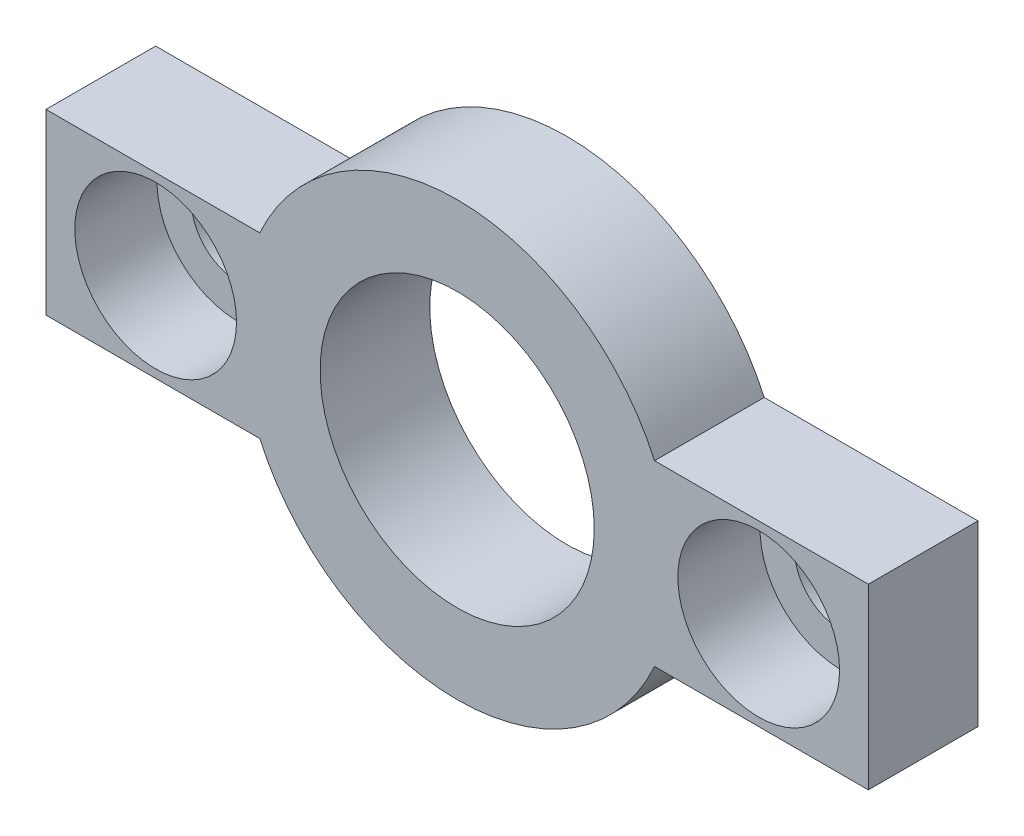
ISO-10303-21;
HEADER;
FILE_DESCRIPTION(('STEP AP214'),'2;1');
FILE_NAME('part.step','',(''),(''),'','','');
FILE_SCHEMA(('AUTOMOTIVE_DESIGN { 1 0 10303 214 1 1 1 1 }'));
ENDSEC;
DATA;
#1=APPLICATION_CONTEXT('core data for automotive mechanical design processes');
#2=APPLICATION_PROTOCOL_DEFINITION('international standard','automotive_design',2000,#1);
#3=PRODUCT_CONTEXT('',#1,'mechanical');
#4=PRODUCT('Part','Part','',(#3));
#5=PRODUCT_RELATED_PRODUCT_CATEGORY('part','',(#4));
#6=PRODUCT_DEFINITION_FORMATION('','',#4);
#7=PRODUCT_DEFINITION_CONTEXT('part definition',#1,'design');
#8=PRODUCT_DEFINITION('design','',#6,#7);
#9=PRODUCT_DEFINITION_SHAPE('','',#8);
#10=(LENGTH_UNIT() NAMED_UNIT(*) SI_UNIT(.MILLI.,.METRE.));
#11=(NAMED_UNIT(*) PLANE_ANGLE_UNIT() SI_UNIT($,.RADIAN.));
#12=(NAMED_UNIT(*) SI_UNIT($,.STERADIAN.) SOLID_ANGLE_UNIT());
#13=UNCERTAINTY_MEASURE_WITH_UNIT(LENGTH_MEASURE(1.E-05),#10,'distance_accuracy_value','');
#14=(GEOMETRIC_REPRESENTATION_CONTEXT(3) GLOBAL_UNCERTAINTY_ASSIGNED_CONTEXT((#13)) GLOBAL_UNIT_ASSIGNED_CONTEXT((#10,
#11,#12)) REPRESENTATION_CONTEXT('',''));
#15=CARTESIAN_POINT('',(0.,0.,0.));
#16=DIRECTION('',(0.,0.,1.));
#17=DIRECTION('',(1.,0.,0.));
#18=AXIS2_PLACEMENT_3D('',#15,#16,#17);
#19=CARTESIAN_POINT('',(11.,0.,1.));
#20=DIRECTION('',(0.,0.,1.));
#21=DIRECTION('',(1.,0.,0.));
#22=AXIS2_PLACEMENT_3D('',#19,#20,#21);
#23=PLANE('',#22);
#24=CARTESIAN_POINT('',(11.,0.,1.));
#25=DIRECTION('',(0.,0.,-1.));
#26=DIRECTION('',(1.,0.,0.));
#27=AXIS2_PLACEMENT_3D('',#24,#25,#26);
#28=CIRCLE('',#27,1.7);
#29=CARTESIAN_POINT('',(12.7,0.,1.));
#30=VERTEX_POINT('',#29);
#31=EDGE_CURVE('E262',#30,#30,#28,.T.);
#32=ORIENTED_EDGE('',*,*,#31,.T.);
#33=EDGE_LOOP('',(#32));
#34=FACE_BOUND('',#33,.T.);
#35=CARTESIAN_POINT('',(11.,0.,1.));
#36=DIRECTION('',(0.,0.,1.));
#37=DIRECTION('',(1.,0.,0.));
#38=AXIS2_PLACEMENT_3D('',#35,#36,#37);
#39=CIRCLE('',#38,2.95);
#40=CARTESIAN_POINT('',(13.95,0.,1.));
#41=VERTEX_POINT('',#40);
#42=EDGE_CURVE('E10',#41,#41,#39,.T.);
#43=ORIENTED_EDGE('',*,*,#42,.T.);
#44=EDGE_LOOP('',(#43));
#45=FACE_BOUND('',#44,.T.);
#46=ADVANCED_FACE('F15',(#34,#45),#23,.T.);
#47=CARTESIAN_POINT('',(-11.,0.,1.));
#48=DIRECTION('',(0.,0.,1.));
#49=DIRECTION('',(1.,0.,0.));
#50=AXIS2_PLACEMENT_3D('',#47,#48,#49);
#51=PLANE('',#50);
#52=CARTESIAN_POINT('',(-11.,0.,1.));
#53=DIRECTION('',(0.,0.,-1.));
#54=DIRECTION('',(1.,0.,0.));
#55=AXIS2_PLACEMENT_3D('',#52,#53,#54);
#56=CIRCLE('',#55,1.7);
#57=CARTESIAN_POINT('',(-9.3,0.,1.));
#58=VERTEX_POINT('',#57);
#59=EDGE_CURVE('E206',#58,#58,#56,.T.);
#60=ORIENTED_EDGE('',*,*,#59,.T.);
#61=EDGE_LOOP('',(#60));
#62=FACE_BOUND('',#61,.T.);
#63=CARTESIAN_POINT('',(-11.,0.,1.));
#64=DIRECTION('',(0.,0.,1.));
#65=DIRECTION('',(1.,0.,0.));
#66=AXIS2_PLACEMENT_3D('',#63,#64,#65);
#67=CIRCLE('',#66,2.95);
#68=CARTESIAN_POINT('',(-8.05,0.,1.));
#69=VERTEX_POINT('',#68);
#70=EDGE_CURVE('E211',#69,#69,#67,.T.);
#71=ORIENTED_EDGE('',*,*,#70,.T.);
#72=EDGE_LOOP('',(#71));
#73=FACE_BOUND('',#72,.T.);
#74=ADVANCED_FACE('F314',(#62,#73),#51,.T.);
#75=CARTESIAN_POINT('',(11.,0.,4.));
#76=DIRECTION('',(0.,0.,1.));
#77=DIRECTION('',(1.,0.,0.));
#78=AXIS2_PLACEMENT_3D('',#75,#76,#77);
#79=CYLINDRICAL_SURFACE('',#78,2.95);
#80=CARTESIAN_POINT('',(11.,0.,4.));
#81=DIRECTION('',(0.,0.,1.));
#82=DIRECTION('',(1.,0.,0.));
#83=AXIS2_PLACEMENT_3D('',#80,#81,#82);
#84=CIRCLE('',#83,2.95);
#85=CARTESIAN_POINT('',(13.95,0.,4.));
#86=VERTEX_POINT('',#85);
#87=EDGE_CURVE('E156',#86,#86,#84,.T.);
#88=ORIENTED_EDGE('',*,*,#87,.T.);
#89=DIRECTION('',(0.,0.,-1.));
#90=VECTOR('',#89,1.);
#91=CARTESIAN_POINT('',(13.95,0.,4.));
#92=LINE('',#91,#90);
#93=EDGE_CURVE('E26',#86,#41,#92,.T.);
#94=ORIENTED_EDGE('',*,*,#93,.T.);
#95=ORIENTED_EDGE('',*,*,#42,.F.);
#96=ORIENTED_EDGE('',*,*,#93,.F.);
#97=EDGE_LOOP('',(#88,#94,#95,#96));
#98=FACE_BOUND('',#97,.T.);
#99=ADVANCED_FACE('F320',(#98),#79,.F.);
#100=CARTESIAN_POINT('',(-11.,0.,4.));
#101=DIRECTION('',(0.,0.,1.));
#102=DIRECTION('',(1.,0.,0.));
#103=AXIS2_PLACEMENT_3D('',#100,#101,#102);
#104=CYLINDRICAL_SURFACE('',#103,2.95);
#105=CARTESIAN_POINT('',(-11.,0.,4.));
#106=DIRECTION('',(0.,0.,1.));
#107=DIRECTION('',(1.,0.,0.));
#108=AXIS2_PLACEMENT_3D('',#105,#106,#107);
#109=CIRCLE('',#108,2.95);
#110=CARTESIAN_POINT('',(-8.05,0.,4.));
#111=VERTEX_POINT('',#110);
#112=EDGE_CURVE('E188',#111,#111,#109,.T.);
#113=ORIENTED_EDGE('',*,*,#112,.T.);
#114=DIRECTION('',(0.,0.,-1.));
#115=VECTOR('',#114,1.);
#116=CARTESIAN_POINT('',(-8.05,0.,4.));
#117=LINE('',#116,#115);
#118=EDGE_CURVE('E207',#111,#69,#117,.T.);
#119=ORIENTED_EDGE('',*,*,#118,.T.);
#120=ORIENTED_EDGE('',*,*,#70,.F.);
#121=ORIENTED_EDGE('',*,*,#118,.F.);
#122=EDGE_LOOP('',(#113,#119,#120,#121));
#123=FACE_BOUND('',#122,.T.);
#124=ADVANCED_FACE('F324',(#123),#104,.F.);
#125=CARTESIAN_POINT('',(11.,0.,0.));
#126=DIRECTION('',(0.,0.,-1.));
#127=DIRECTION('',(1.,0.,0.));
#128=AXIS2_PLACEMENT_3D('',#125,#126,#127);
#129=CYLINDRICAL_SURFACE('',#128,1.7);
#130=ORIENTED_EDGE('',*,*,#31,.F.);
#131=DIRECTION('',(0.,0.,1.));
#132=VECTOR('',#131,1.);
#133=CARTESIAN_POINT('',(12.7,0.,0.));
#134=LINE('',#133,#132);
#135=CARTESIAN_POINT('',(12.7,0.,0.));
#136=VERTEX_POINT('',#135);
#137=EDGE_CURVE('E183',#136,#30,#134,.T.);
#138=ORIENTED_EDGE('',*,*,#137,.F.);
#139=CARTESIAN_POINT('',(11.,0.,0.));
#140=DIRECTION('',(0.,0.,-1.));
#141=DIRECTION('',(1.,0.,0.));
#142=AXIS2_PLACEMENT_3D('',#139,#140,#141);
#143=CIRCLE('',#142,1.7);
#144=EDGE_CURVE('E224',#136,#136,#143,.T.);
#145=ORIENTED_EDGE('',*,*,#144,.T.);
#146=ORIENTED_EDGE('',*,*,#137,.T.);
#147=EDGE_LOOP('',(#130,#138,#145,#146));
#148=FACE_BOUND('',#147,.T.);
#149=ADVANCED_FACE('F327',(#148),#129,.F.);
#150=CARTESIAN_POINT('',(0.,0.,0.));
#151=DIRECTION('',(0.,0.,-1.));
#152=DIRECTION('',(1.,0.,0.));
#153=AXIS2_PLACEMENT_3D('',#150,#151,#152);
#154=CYLINDRICAL_SURFACE('',#153,5.);
#155=DIRECTION('',(0.,0.,1.));
#156=VECTOR('',#155,1.);
#157=CARTESIAN_POINT('',(5.,0.,0.));
#158=LINE('',#157,#156);
#159=CARTESIAN_POINT('',(5.,0.,0.));
#160=VERTEX_POINT('',#159);
#161=CARTESIAN_POINT('',(5.,0.,4.));
#162=VERTEX_POINT('',#161);
#163=EDGE_CURVE('E205',#160,#162,#158,.T.);
#164=ORIENTED_EDGE('',*,*,#163,.T.);
#165=CARTESIAN_POINT('',(0.,0.,4.));
#166=DIRECTION('',(0.,0.,1.));
#167=DIRECTION('',(1.,0.,0.));
#168=AXIS2_PLACEMENT_3D('',#165,#166,#167);
#169=CIRCLE('',#168,5.);
#170=EDGE_CURVE('E192',#162,#162,#169,.T.);
#171=ORIENTED_EDGE('',*,*,#170,.T.);
#172=ORIENTED_EDGE('',*,*,#163,.F.);
#173=CARTESIAN_POINT('',(0.,0.,0.));
#174=DIRECTION('',(0.,0.,1.));
#175=DIRECTION('',(1.,0.,0.));
#176=AXIS2_PLACEMENT_3D('',#173,#174,#175);
#177=CIRCLE('',#176,5.);
#178=EDGE_CURVE('E243',#160,#160,#177,.T.);
#179=ORIENTED_EDGE('',*,*,#178,.F.);
#180=EDGE_LOOP('',(#164,#171,#172,#179));
#181=FACE_BOUND('',#180,.T.);
#182=ADVANCED_FACE('F344',(#181),#154,.F.);
#183=CARTESIAN_POINT('',(-11.,0.,0.));
#184=DIRECTION('',(0.,0.,-1.));
#185=DIRECTION('',(1.,0.,0.));
#186=AXIS2_PLACEMENT_3D('',#183,#184,#185);
#187=CYLINDRICAL_SURFACE('',#186,1.7);
#188=ORIENTED_EDGE('',*,*,#59,.F.);
#189=DIRECTION('',(0.,0.,1.));
#190=VECTOR('',#189,1.);
#191=CARTESIAN_POINT('',(-9.3,0.,0.));
#192=LINE('',#191,#190);
#193=CARTESIAN_POINT('',(-9.3,0.,0.));
#194=VERTEX_POINT('',#193);
#195=EDGE_CURVE('E202',#194,#58,#192,.T.);
#196=ORIENTED_EDGE('',*,*,#195,.F.);
#197=CARTESIAN_POINT('',(-11.,0.,0.));
#198=DIRECTION('',(0.,0.,-1.));
#199=DIRECTION('',(1.,0.,0.));
#200=AXIS2_PLACEMENT_3D('',#197,#198,#199);
#201=CIRCLE('',#200,1.7);
#202=EDGE_CURVE('E233',#194,#194,#201,.T.);
#203=ORIENTED_EDGE('',*,*,#202,.T.);
#204=ORIENTED_EDGE('',*,*,#195,.T.);
#205=EDGE_LOOP('',(#188,#196,#203,#204));
#206=FACE_BOUND('',#205,.T.);
#207=ADVANCED_FACE('F342',(#206),#187,.F.);
#208=CARTESIAN_POINT('',(0.,0.,0.));
#209=DIRECTION('',(0.,0.,-1.));
#210=DIRECTION('',(1.,0.,0.));
#211=AXIS2_PLACEMENT_3D('',#208,#209,#210);
#212=CYLINDRICAL_SURFACE('',#211,7.9);
#213=CARTESIAN_POINT('',(0.,0.,0.));
#214=DIRECTION('',(0.,0.,1.));
#215=DIRECTION('',(1.,0.,0.));
#216=AXIS2_PLACEMENT_3D('',#213,#214,#215);
#217=CIRCLE('',#216,7.9);
#218=CARTESIAN_POINT('',(-7.200520814497,-3.25,0.));
#219=VERTEX_POINT('',#218);
#220=CARTESIAN_POINT('',(7.200520814497,-3.25,0.));
#221=VERTEX_POINT('',#220);
#222=EDGE_CURVE('E165',#219,#221,#217,.T.);
#223=ORIENTED_EDGE('',*,*,#222,.T.);
#224=DIRECTION('',(0.,0.,1.));
#225=VECTOR('',#224,1.);
#226=CARTESIAN_POINT('',(7.200520814497,-3.25,0.));
#227=LINE('',#226,#225);
#228=CARTESIAN_POINT('',(7.200520814497,-3.25,4.));
#229=VERTEX_POINT('',#228);
#230=EDGE_CURVE('E161',#221,#229,#227,.T.);
#231=ORIENTED_EDGE('',*,*,#230,.T.);
#232=CARTESIAN_POINT('',(0.,0.,4.));
#233=DIRECTION('',(0.,0.,1.));
#234=DIRECTION('',(1.,0.,0.));
#235=AXIS2_PLACEMENT_3D('',#232,#233,#234);
#236=CIRCLE('',#235,7.9);
#237=CARTESIAN_POINT('',(-7.200520814497,-3.25,4.));
#238=VERTEX_POINT('',#237);
#239=EDGE_CURVE('E200',#238,#229,#236,.T.);
#240=ORIENTED_EDGE('',*,*,#239,.F.);
#241=DIRECTION('',(0.,0.,1.));
#242=VECTOR('',#241,1.);
#243=CARTESIAN_POINT('',(-7.200520814497,-3.25,0.));
#244=LINE('',#243,#242);
#245=EDGE_CURVE('E110',#219,#238,#244,.T.);
#246=ORIENTED_EDGE('',*,*,#245,.F.);
#247=EDGE_LOOP('',(#223,#231,#240,#246));
#248=FACE_BOUND('',#247,.T.);
#249=ADVANCED_FACE('F298',(#248),#212,.T.);
#250=CARTESIAN_POINT('',(-15.,-3.25,0.));
#251=DIRECTION('',(0.,1.,0.));
#252=DIRECTION('',(1.,0.,0.));
#253=AXIS2_PLACEMENT_3D('',#250,#251,#252);
#254=PLANE('',#253);
#255=DIRECTION('',(1.,0.,0.));
#256=VECTOR('',#255,1.);
#257=CARTESIAN_POINT('',(-15.,-3.25,0.));
#258=LINE('',#257,#256);
#259=CARTESIAN_POINT('',(-15.,-3.25,0.));
#260=VERTEX_POINT('',#259);
#261=EDGE_CURVE('E187',#260,#219,#258,.T.);
#262=ORIENTED_EDGE('',*,*,#261,.T.);
#263=ORIENTED_EDGE('',*,*,#245,.T.);
#264=DIRECTION('',(1.,0.,0.));
#265=VECTOR('',#264,1.);
#266=CARTESIAN_POINT('',(-15.,-3.25,4.));
#267=LINE('',#266,#265);
#268=CARTESIAN_POINT('',(-15.,-3.25,4.));
#269=VERTEX_POINT('',#268);
#270=EDGE_CURVE('E196',#269,#238,#267,.T.);
#271=ORIENTED_EDGE('',*,*,#270,.F.);
#272=DIRECTION('',(0.,0.,1.));
#273=VECTOR('',#272,1.);
#274=CARTESIAN_POINT('',(-15.,-3.25,0.));
#275=LINE('',#274,#273);
#276=EDGE_CURVE('E95',#260,#269,#275,.T.);
#277=ORIENTED_EDGE('',*,*,#276,.F.);
#278=EDGE_LOOP('',(#262,#263,#271,#277));
#279=FACE_BOUND('',#278,.T.);
#280=ADVANCED_FACE('F297',(#279),#254,.F.);
#281=CARTESIAN_POINT('',(15.,-3.25,0.));
#282=DIRECTION('',(0.,-1.,0.));
#283=DIRECTION('',(0.,0.,-1.));
#284=AXIS2_PLACEMENT_3D('',#281,#282,#283);
#285=PLANE('',#284);
#286=DIRECTION('',(0.,0.,1.));
#287=VECTOR('',#286,1.);
#288=CARTESIAN_POINT('',(15.,-3.25,0.));
#289=LINE('',#288,#287);
#290=CARTESIAN_POINT('',(15.,-3.25,0.));
#291=VERTEX_POINT('',#290);
#292=CARTESIAN_POINT('',(15.,-3.25,4.));
#293=VERTEX_POINT('',#292);
#294=EDGE_CURVE('E144',#291,#293,#289,.T.);
#295=ORIENTED_EDGE('',*,*,#294,.T.);
#296=DIRECTION('',(-1.,0.,0.));
#297=VECTOR('',#296,1.);
#298=CARTESIAN_POINT('',(15.,-3.25,4.));
#299=LINE('',#298,#297);
#300=EDGE_CURVE('E246',#293,#229,#299,.T.);
#301=ORIENTED_EDGE('',*,*,#300,.T.);
#302=ORIENTED_EDGE('',*,*,#230,.F.);
#303=DIRECTION('',(-1.,0.,0.));
#304=VECTOR('',#303,1.);
#305=CARTESIAN_POINT('',(15.,-3.25,0.));
#306=LINE('',#305,#304);
#307=EDGE_CURVE('E159',#291,#221,#306,.T.);
#308=ORIENTED_EDGE('',*,*,#307,.F.);
#309=EDGE_LOOP('',(#295,#301,#302,#308));
#310=FACE_BOUND('',#309,.T.);
#311=ADVANCED_FACE('F160',(#310),#285,.T.);
#312=CARTESIAN_POINT('',(-15.,3.25,0.));
#313=DIRECTION('',(1.,0.,0.));
#314=DIRECTION('',(0.,1.,0.));
#315=AXIS2_PLACEMENT_3D('',#312,#313,#314);
#316=PLANE('',#315);
#317=DIRECTION('',(0.,-1.,0.));
#318=VECTOR('',#317,1.);
#319=CARTESIAN_POINT('',(-15.,3.25,0.));
#320=LINE('',#319,#318);
#321=CARTESIAN_POINT('',(-15.,3.25,0.));
#322=VERTEX_POINT('',#321);
#323=EDGE_CURVE('E214',#322,#260,#320,.T.);
#324=ORIENTED_EDGE('',*,*,#323,.T.);
#325=ORIENTED_EDGE('',*,*,#276,.T.);
#326=DIRECTION('',(0.,-1.,0.));
#327=VECTOR('',#326,1.);
#328=CARTESIAN_POINT('',(-15.,3.25,4.));
#329=LINE('',#328,#327);
#330=CARTESIAN_POINT('',(-15.,3.25,4.));
#331=VERTEX_POINT('',#330);
#332=EDGE_CURVE('E201',#331,#269,#329,.T.);
#333=ORIENTED_EDGE('',*,*,#332,.F.);
#334=DIRECTION('',(0.,0.,1.));
#335=VECTOR('',#334,1.);
#336=CARTESIAN_POINT('',(-15.,3.25,0.));
#337=LINE('',#336,#335);
#338=EDGE_CURVE('E179',#322,#331,#337,.T.);
#339=ORIENTED_EDGE('',*,*,#338,.F.);
#340=EDGE_LOOP('',(#324,#325,#333,#339));
#341=FACE_BOUND('',#340,.T.);
#342=ADVANCED_FACE('F293',(#341),#316,.F.);
#343=CARTESIAN_POINT('',(15.,3.25,0.));
#344=DIRECTION('',(1.,0.,0.));
#345=DIRECTION('',(0.,1.,0.));
#346=AXIS2_PLACEMENT_3D('',#343,#344,#345);
#347=PLANE('',#346);
#348=DIRECTION('',(0.,0.,1.));
#349=VECTOR('',#348,1.);
#350=CARTESIAN_POINT('',(15.,3.25,0.));
#351=LINE('',#350,#349);
#352=CARTESIAN_POINT('',(15.,3.25,0.));
#353=VERTEX_POINT('',#352);
#354=CARTESIAN_POINT('',(15.,3.25,4.));
#355=VERTEX_POINT('',#354);
#356=EDGE_CURVE('E229',#353,#355,#351,.T.);
#357=ORIENTED_EDGE('',*,*,#356,.T.);
#358=DIRECTION('',(0.,-1.,0.));
#359=VECTOR('',#358,1.);
#360=CARTESIAN_POINT('',(15.,3.25,4.));
#361=LINE('',#360,#359);
#362=EDGE_CURVE('E151',#355,#293,#361,.T.);
#363=ORIENTED_EDGE('',*,*,#362,.T.);
#364=ORIENTED_EDGE('',*,*,#294,.F.);
#365=DIRECTION('',(0.,-1.,0.));
#366=VECTOR('',#365,1.);
#367=CARTESIAN_POINT('',(15.,3.25,0.));
#368=LINE('',#367,#366);
#369=EDGE_CURVE('E149',#353,#291,#368,.T.);
#370=ORIENTED_EDGE('',*,*,#369,.F.);
#371=EDGE_LOOP('',(#357,#363,#364,#370));
#372=FACE_BOUND('',#371,.T.);
#373=ADVANCED_FACE('F147',(#372),#347,.T.);
#374=CARTESIAN_POINT('',(0.,0.,4.));
#375=DIRECTION('',(0.,0.,1.));
#376=DIRECTION('',(1.,0.,0.));
#377=AXIS2_PLACEMENT_3D('',#374,#375,#376);
#378=PLANE('',#377);
#379=ORIENTED_EDGE('',*,*,#87,.F.);
#380=EDGE_LOOP('',(#379));
#381=FACE_BOUND('',#380,.T.);
#382=ORIENTED_EDGE('',*,*,#170,.F.);
#383=EDGE_LOOP('',(#382));
#384=FACE_BOUND('',#383,.T.);
#385=ORIENTED_EDGE('',*,*,#112,.F.);
#386=EDGE_LOOP('',(#385));
#387=FACE_BOUND('',#386,.T.);
#388=CARTESIAN_POINT('',(0.,0.,4.));
#389=DIRECTION('',(0.,0.,1.));
#390=DIRECTION('',(1.,0.,0.));
#391=AXIS2_PLACEMENT_3D('',#388,#389,#390);
#392=CIRCLE('',#391,7.9);
#393=CARTESIAN_POINT('',(7.200520814497,3.25,4.));
#394=VERTEX_POINT('',#393);
#395=CARTESIAN_POINT('',(-7.200520814497,3.25,4.));
#396=VERTEX_POINT('',#395);
#397=EDGE_CURVE('E270',#394,#396,#392,.T.);
#398=ORIENTED_EDGE('',*,*,#397,.T.);
#399=DIRECTION('',(-1.,0.,0.));
#400=VECTOR('',#399,1.);
#401=CARTESIAN_POINT('',(-7.200520814497,3.25,4.));
#402=LINE('',#401,#400);
#403=EDGE_CURVE('E172',#396,#331,#402,.T.);
#404=ORIENTED_EDGE('',*,*,#403,.T.);
#405=ORIENTED_EDGE('',*,*,#332,.T.);
#406=ORIENTED_EDGE('',*,*,#270,.T.);
#407=ORIENTED_EDGE('',*,*,#239,.T.);
#408=ORIENTED_EDGE('',*,*,#300,.F.);
#409=ORIENTED_EDGE('',*,*,#362,.F.);
#410=DIRECTION('',(1.,0.,0.));
#411=VECTOR('',#410,1.);
#412=CARTESIAN_POINT('',(7.200520814497,3.25,4.));
#413=LINE('',#412,#411);
#414=EDGE_CURVE('E225',#394,#355,#413,.T.);
#415=ORIENTED_EDGE('',*,*,#414,.F.);
#416=EDGE_LOOP('',(#398,#404,#405,#406,#407,#408,#409,#415));
#417=FACE_BOUND('',#416,.T.);
#418=ADVANCED_FACE('F291',(#381,#384,#387,#417),#378,.T.);
#419=CARTESIAN_POINT('',(0.,0.,0.));
#420=DIRECTION('',(0.,0.,1.));
#421=DIRECTION('',(1.,0.,0.));
#422=AXIS2_PLACEMENT_3D('',#419,#420,#421);
#423=PLANE('',#422);
#424=ORIENTED_EDGE('',*,*,#144,.F.);
#425=EDGE_LOOP('',(#424));
#426=FACE_BOUND('',#425,.T.);
#427=ORIENTED_EDGE('',*,*,#178,.T.);
#428=EDGE_LOOP('',(#427));
#429=FACE_BOUND('',#428,.T.);
#430=ORIENTED_EDGE('',*,*,#202,.F.);
#431=EDGE_LOOP('',(#430));
#432=FACE_BOUND('',#431,.T.);
#433=DIRECTION('',(1.,0.,0.));
#434=VECTOR('',#433,1.);
#435=CARTESIAN_POINT('',(7.200520814497,3.25,0.));
#436=LINE('',#435,#434);
#437=CARTESIAN_POINT('',(7.200520814497,3.25,0.));
#438=VERTEX_POINT('',#437);
#439=EDGE_CURVE('E169',#438,#353,#436,.T.);
#440=ORIENTED_EDGE('',*,*,#439,.T.);
#441=ORIENTED_EDGE('',*,*,#369,.T.);
#442=ORIENTED_EDGE('',*,*,#307,.T.);
#443=ORIENTED_EDGE('',*,*,#222,.F.);
#444=ORIENTED_EDGE('',*,*,#261,.F.);
#445=ORIENTED_EDGE('',*,*,#323,.F.);
#446=DIRECTION('',(-1.,0.,0.));
#447=VECTOR('',#446,1.);
#448=CARTESIAN_POINT('',(-7.200520814497,3.25,0.));
#449=LINE('',#448,#447);
#450=CARTESIAN_POINT('',(-7.200520814497,3.25,0.));
#451=VERTEX_POINT('',#450);
#452=EDGE_CURVE('E249',#451,#322,#449,.T.);
#453=ORIENTED_EDGE('',*,*,#452,.F.);
#454=CARTESIAN_POINT('',(0.,0.,0.));
#455=DIRECTION('',(0.,0.,1.));
#456=DIRECTION('',(1.,0.,0.));
#457=AXIS2_PLACEMENT_3D('',#454,#455,#456);
#458=CIRCLE('',#457,7.9);
#459=EDGE_CURVE('E215',#438,#451,#458,.T.);
#460=ORIENTED_EDGE('',*,*,#459,.F.);
#461=EDGE_LOOP('',(#440,#441,#442,#443,#444,#445,#453,#460));
#462=FACE_BOUND('',#461,.T.);
#463=ADVANCED_FACE('F167',(#426,#429,#432,#462),#423,.F.);
#464=CARTESIAN_POINT('',(-7.200520814497,3.25,0.));
#465=DIRECTION('',(0.,-1.,0.));
#466=DIRECTION('',(0.,0.,-1.));
#467=AXIS2_PLACEMENT_3D('',#464,#465,#466);
#468=PLANE('',#467);
#469=ORIENTED_EDGE('',*,*,#452,.T.);
#470=ORIENTED_EDGE('',*,*,#338,.T.);
#471=ORIENTED_EDGE('',*,*,#403,.F.);
#472=DIRECTION('',(0.,0.,1.));
#473=VECTOR('',#472,1.);
#474=CARTESIAN_POINT('',(-7.200520814497,3.25,0.));
#475=LINE('',#474,#473);
#476=EDGE_CURVE('E19',#451,#396,#475,.T.);
#477=ORIENTED_EDGE('',*,*,#476,.F.);
#478=EDGE_LOOP('',(#469,#470,#471,#477));
#479=FACE_BOUND('',#478,.T.);
#480=ADVANCED_FACE('F288',(#479),#468,.F.);
#481=CARTESIAN_POINT('',(7.200520814497,3.25,0.));
#482=DIRECTION('',(0.,1.,0.));
#483=DIRECTION('',(1.,0.,0.));
#484=AXIS2_PLACEMENT_3D('',#481,#482,#483);
#485=PLANE('',#484);
#486=DIRECTION('',(0.,0.,1.));
#487=VECTOR('',#486,1.);
#488=CARTESIAN_POINT('',(7.200520814497,3.25,0.));
#489=LINE('',#488,#487);
#490=EDGE_CURVE('E230',#438,#394,#489,.T.);
#491=ORIENTED_EDGE('',*,*,#490,.T.);
#492=ORIENTED_EDGE('',*,*,#414,.T.);
#493=ORIENTED_EDGE('',*,*,#356,.F.);
#494=ORIENTED_EDGE('',*,*,#439,.F.);
#495=EDGE_LOOP('',(#491,#492,#493,#494));
#496=FACE_BOUND('',#495,.T.);
#497=ADVANCED_FACE('F302',(#496),#485,.T.);
#498=CARTESIAN_POINT('',(0.,0.,0.));
#499=DIRECTION('',(0.,0.,-1.));
#500=DIRECTION('',(1.,0.,0.));
#501=AXIS2_PLACEMENT_3D('',#498,#499,#500);
#502=CYLINDRICAL_SURFACE('',#501,7.9);
#503=ORIENTED_EDGE('',*,*,#459,.T.);
#504=ORIENTED_EDGE('',*,*,#476,.T.);
#505=ORIENTED_EDGE('',*,*,#397,.F.);
#506=ORIENTED_EDGE('',*,*,#490,.F.);
#507=EDGE_LOOP('',(#503,#504,#505,#506));
#508=FACE_BOUND('',#507,.T.);
#509=ADVANCED_FACE('F17',(#508),#502,.T.);
#510=CLOSED_SHELL('',(#46,#74,#99,#124,#149,#182,#207,#249,#280,#311,#342,#373,#418,#463,#480,
#497,#509));
#511=MANIFOLD_SOLID_BREP('B1',#510);
#512=ADVANCED_BREP_SHAPE_REPRESENTATION('',(#18,#511),#14);
#513=SHAPE_DEFINITION_REPRESENTATION(#9,#512);
ENDSEC;
END-ISO-10303-21;
